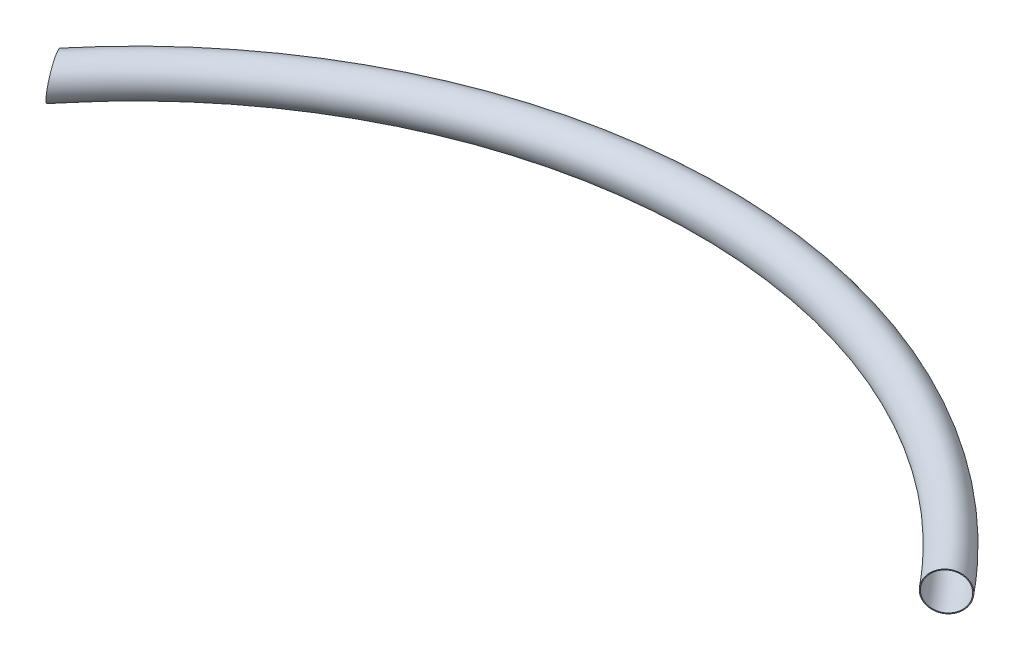
ISO-10303-21;
HEADER;
FILE_DESCRIPTION(('STEP AP214'),'2;1');
FILE_NAME('part.step','',(''),(''),'','','');
FILE_SCHEMA(('AUTOMOTIVE_DESIGN { 1 0 10303 214 1 1 1 1 }'));
ENDSEC;
DATA;
#1=APPLICATION_CONTEXT('core data for automotive mechanical design processes');
#2=APPLICATION_PROTOCOL_DEFINITION('international standard','automotive_design',2000,#1);
#3=PRODUCT_CONTEXT('',#1,'mechanical');
#4=PRODUCT('Part','Part','',(#3));
#5=PRODUCT_RELATED_PRODUCT_CATEGORY('part','',(#4));
#6=PRODUCT_DEFINITION_FORMATION('','',#4);
#7=PRODUCT_DEFINITION_CONTEXT('part definition',#1,'design');
#8=PRODUCT_DEFINITION('design','',#6,#7);
#9=PRODUCT_DEFINITION_SHAPE('','',#8);
#10=(LENGTH_UNIT() NAMED_UNIT(*) SI_UNIT(.MILLI.,.METRE.));
#11=(NAMED_UNIT(*) PLANE_ANGLE_UNIT() SI_UNIT($,.RADIAN.));
#12=(NAMED_UNIT(*) SI_UNIT($,.STERADIAN.) SOLID_ANGLE_UNIT());
#13=UNCERTAINTY_MEASURE_WITH_UNIT(LENGTH_MEASURE(1.E-05),#10,'distance_accuracy_value','');
#14=(GEOMETRIC_REPRESENTATION_CONTEXT(3) GLOBAL_UNCERTAINTY_ASSIGNED_CONTEXT((#13)) GLOBAL_UNIT_ASSIGNED_CONTEXT((#10,
#11,#12)) REPRESENTATION_CONTEXT('',''));
#15=CARTESIAN_POINT('',(0.,0.,0.));
#16=DIRECTION('',(0.,0.,1.));
#17=DIRECTION('',(1.,0.,0.));
#18=AXIS2_PLACEMENT_3D('',#15,#16,#17);
#19=CARTESIAN_POINT('',(0.,0.,1141.91160740362));
#20=DIRECTION('',(0.,-1.,0.));
#21=DIRECTION('',(0.,0.,-1.));
#22=AXIS2_PLACEMENT_3D('',#19,#20,#21);
#23=TOROIDAL_SURFACE('',#22,2500.81160740362,80.7338999999999);
#24=CARTESIAN_POINT('',(-1979.20686929793,-35.3852383598707,-502.780856281421));
#25=CARTESIAN_POINT('',(-1979.3991245248,-34.4097320346067,-503.293783131036));
#26=CARTESIAN_POINT('',(-1979.58008716303,-33.4234639280079,-503.790337505917));
#27=CARTESIAN_POINT('',(-1979.91897412592,-31.4308692296872,-504.749660949201));
#28=CARTESIAN_POINT('',(-1980.07690156036,-30.4245453663966,-505.212434573812));
#29=CARTESIAN_POINT('',(-1980.36933264064,-28.3931034040865,-506.103307878676));
#30=CARTESIAN_POINT('',(-1980.50383206896,-27.3679819577447,-506.531401308362));
#31=CARTESIAN_POINT('',(-1980.74898213253,-25.3006826151863,-507.351864955006));
#32=CARTESIAN_POINT('',(-1980.85963191885,-24.2585041132471,-507.744233900069));
#33=CARTESIAN_POINT('',(-1981.05676831842,-22.1582614653444,-508.492495595245));
#34=CARTESIAN_POINT('',(-1981.14324238078,-21.1001893674171,-508.848369338327));
#35=CARTESIAN_POINT('',(-1981.29164037947,-18.9703377150809,-509.522564850369));
#36=CARTESIAN_POINT('',(-1981.35356212045,-17.8985569437548,-509.840883259542));
#37=CARTESIAN_POINT('',(-1981.4525659267,-15.7433195508101,-510.439081929846));
#38=CARTESIAN_POINT('',(-1981.48965094582,-14.6598643332236,-510.718966758772));
#39=CARTESIAN_POINT('',(-1981.53877120841,-12.4829229907933,-511.239620734417));
#40=CARTESIAN_POINT('',(-1981.55080413865,-11.3894359490102,-511.480386267112));
#41=CARTESIAN_POINT('',(-1981.54963958368,-9.19268637284343,-511.922453337221));
#42=CARTESIAN_POINT('',(-1981.53640135289,-8.0894109112362,-512.123690564743));
#43=CARTESIAN_POINT('',(-1981.48449256695,-5.87671522718252,-512.485635600726));
#44=CARTESIAN_POINT('',(-1981.4458195946,-4.76729443064839,-512.646339555076));
#45=CARTESIAN_POINT('',(-1981.34298157329,-2.54453611819841,-512.92666960051));
#46=CARTESIAN_POINT('',(-1981.27881851067,-1.43119891417158,-513.046298891027));
#47=CARTESIAN_POINT('',(-1981.12499158504,0.797507777516503,-513.244084421601));
#48=CARTESIAN_POINT('',(-1981.03532525997,1.91287745105521,-513.322236655431));
#49=CARTESIAN_POINT('',(-1980.83058715901,4.14307701744504,-513.436704845798));
#50=CARTESIAN_POINT('',(-1980.715523482,5.25790696908317,-513.47303411621));
#51=CARTESIAN_POINT('',(-1980.46008741844,7.48535285808895,-513.503676897148));
#52=CARTESIAN_POINT('',(-1980.31971249135,8.59796856186196,-513.497986187721));
#53=CARTESIAN_POINT('',(-1980.01386331799,10.8186100605355,-513.444452735829));
#54=CARTESIAN_POINT('',(-1979.84839218149,11.9266364066669,-513.396615212387));
#55=CARTESIAN_POINT('',(-1979.49259951448,14.136086708019,-513.258790241673));
#56=CARTESIAN_POINT('',(-1979.30227564159,15.2375100306537,-513.168798819299));
#57=CARTESIAN_POINT('',(-1978.70717079521,18.4598326055181,-512.842624740278));
#58=CARTESIAN_POINT('',(-1978.26853304244,20.5690309131438,-512.548469165553));
#59=CARTESIAN_POINT('',(-1977.30217837921,24.7385461549988,-511.803970653447));
#60=CARTESIAN_POINT('',(-1976.77446332982,26.7988641094487,-511.353630978977));
#61=CARTESIAN_POINT('',(-1975.63384164525,30.8557352386496,-510.300141360386));
#62=CARTESIAN_POINT('',(-1975.02094243889,32.8522939551199,-509.697004737744));
#63=CARTESIAN_POINT('',(-1973.71464122692,36.767308869152,-508.342724554317));
#64=CARTESIAN_POINT('',(-1973.02123946605,38.6857653041252,-507.591581443474));
#65=CARTESIAN_POINT('',(-1971.57000943179,42.403812241093,-505.959454185326));
#66=CARTESIAN_POINT('',(-1970.81326552163,44.2047262215226,-505.080518535497));
#67=CARTESIAN_POINT('',(-1969.23265760134,47.7057112443546,-503.192024700908));
#68=CARTESIAN_POINT('',(-1968.40879458239,49.4057837752954,-502.182468444964));
#69=CARTESIAN_POINT('',(-1966.70014661937,52.6944525477766,-500.040764509439));
#70=CARTESIAN_POINT('',(-1965.81536007325,54.2830458556494,-498.908613605673));
#71=CARTESIAN_POINT('',(-1963.99143946698,57.3392969371135,-496.530606730909));
#72=CARTESIAN_POINT('',(-1963.05230429106,58.8069522263534,-495.284748425202));
#73=CARTESIAN_POINT('',(-1961.10499502209,61.6444780953998,-492.659875808819));
#74=CARTESIAN_POINT('',(-1960.09574843969,63.0114385623151,-491.278511832025));
#75=CARTESIAN_POINT('',(-1958.03493708867,65.6031536085332,-488.417537480918));
#76=CARTESIAN_POINT('',(-1956.98337192124,66.8279068472306,-486.937926180623));
#77=CARTESIAN_POINT('',(-1954.84517020738,69.1294613242307,-483.891198368159));
#78=CARTESIAN_POINT('',(-1953.7585288182,70.2062420240797,-482.324069751034));
#79=CARTESIAN_POINT('',(-1951.55763331375,72.2070590909237,-479.113589202808));
#80=CARTESIAN_POINT('',(-1950.44337839745,73.1310910208971,-477.470235059294));
#81=CARTESIAN_POINT('',(-1948.13815927148,74.8653294362463,-474.034530603023));
#82=CARTESIAN_POINT('',(-1946.94614646326,75.6675272768953,-472.238839411558));
#83=CARTESIAN_POINT('',(-1944.54773113599,77.0970553839469,-468.588480581178));
#84=CARTESIAN_POINT('',(-1943.34132820753,77.7243806624433,-466.733811261704));
#85=CARTESIAN_POINT('',(-1940.92175009196,78.802782977862,-462.977728416542));
#86=CARTESIAN_POINT('',(-1939.70857358884,79.2538244642697,-461.076305544327));
#87=CARTESIAN_POINT('',(-1937.28325281461,79.9790415127317,-457.239409241176));
#88=CARTESIAN_POINT('',(-1936.07110857424,80.253211979053,-455.303934830851));
#89=CARTESIAN_POINT('',(-1933.5832744689,80.6361808602753,-451.295192547975));
#90=CARTESIAN_POINT('',(-1932.30809119031,80.7341781945253,-449.220573737698));
#91=CARTESIAN_POINT('',(-1929.77538238225,80.7336205870288,-445.060613378186));
#92=CARTESIAN_POINT('',(-1928.51785750743,80.6350583775755,-442.975271435312));
#93=CARTESIAN_POINT('',(-1926.02822139539,80.2436950901279,-438.807071027152));
#94=CARTESIAN_POINT('',(-1924.7961155865,79.9508529568476,-436.724213180026));
#95=CARTESIAN_POINT('',(-1922.36530580337,79.1740204650871,-432.57472582036));
#96=CARTESIAN_POINT('',(-1921.16660249877,78.6900262774274,-430.508096633761));
#97=CARTESIAN_POINT('',(-1918.75570341682,77.5080443416732,-426.309427822483));
#98=CARTESIAN_POINT('',(-1917.54543333223,76.801219731487,-424.17876505492));
#99=CARTESIAN_POINT('',(-1915.17790837901,75.1876982227603,-419.964118653642));
#100=CARTESIAN_POINT('',(-1914.02065529094,74.2809946172786,-417.880136588884));
#101=CARTESIAN_POINT('',(-1911.767103255,72.2735066983154,-413.773061401993));
#102=CARTESIAN_POINT('',(-1910.67081324538,71.1726940231878,-411.749977228405));
#103=CARTESIAN_POINT('',(-1908.54734944141,68.7839606221136,-407.779512851352));
#104=CARTESIAN_POINT('',(-1907.52017550308,67.4960402859469,-405.832132490193));
#105=CARTESIAN_POINT('',(-1905.53111871811,64.7245475347052,-402.005066350618));
#106=CARTESIAN_POINT('',(-1904.57012747232,63.2388862905342,-400.126422813802));
#107=CARTESIAN_POINT('',(-1903.19377060545,60.8798779421934,-397.389051908668));
#108=CARTESIAN_POINT('',(-1902.74577686396,60.0716563517342,-396.489896844471));
#109=CARTESIAN_POINT('',(-1901.87240942962,58.4128565547509,-394.720178421511));
#110=CARTESIAN_POINT('',(-1901.44703342148,57.5622827009975,-393.849612139725));
#111=CARTESIAN_POINT('',(-1900.61983190796,55.8200388420599,-392.138854255443));
#112=CARTESIAN_POINT('',(-1900.21800783735,54.9283663390361,-391.298664504683));
#113=CARTESIAN_POINT('',(-1899.43891397681,53.1054675284855,-389.650620057563));
#114=CARTESIAN_POINT('',(-1899.0616416026,52.1742454009919,-388.842761961485));
#115=CARTESIAN_POINT('',(-1898.33250971175,50.2735987282997,-387.261064118955));
#116=CARTESIAN_POINT('',(-1897.98065220301,49.3041711740294,-386.487227062207));
#117=CARTESIAN_POINT('',(-1897.30333029898,47.328898438217,-384.975542039371));
#118=CARTESIAN_POINT('',(-1896.97786293388,46.3230573729528,-384.237690027435));
#119=CARTESIAN_POINT('',(-1896.36427755386,44.3097517455021,-382.82300232389));
#120=CARTESIAN_POINT('',(-1896.07529082022,43.3033967550287,-382.144964058068));
#121=CARTESIAN_POINT('',(-1895.52362731844,41.2598693025282,-380.825871884782));
#122=CARTESIAN_POINT('',(-1895.26094760298,40.2227003096928,-380.184813837629));
#123=CARTESIAN_POINT('',(-1894.76258654337,38.119080354742,-378.941123110482));
#124=CARTESIAN_POINT('',(-1894.52690813079,37.0526262286418,-378.338494605994));
#125=CARTESIAN_POINT('',(-1894.0833247529,34.892521313549,-377.17335744398));
#126=CARTESIAN_POINT('',(-1893.87541678151,33.7988734834168,-376.610844447153));
#127=CARTESIAN_POINT('',(-1893.48806051126,31.5864488498346,-375.527483286934));
#128=CARTESIAN_POINT('',(-1893.30860686449,30.4676768136249,-375.006627303391));
#129=CARTESIAN_POINT('',(-1892.97876517007,28.2070086670862,-374.007980579284));
#130=CARTESIAN_POINT('',(-1892.82837395298,27.0651150933308,-373.530185145729));
#131=CARTESIAN_POINT('',(-1892.55721619487,24.7602715033133,-372.61899566165));
#132=CARTESIAN_POINT('',(-1892.43644989559,23.5973213153167,-372.185601973452));
#133=CARTESIAN_POINT('',(-1892.22507230736,21.2526888629363,-371.364556799671));
#134=CARTESIAN_POINT('',(-1892.13446055547,20.0710068864204,-370.97690461191));
#135=CARTESIAN_POINT('',(-1891.988678112,17.7675641181711,-370.271920934094));
#136=CARTESIAN_POINT('',(-1891.93160887285,16.6468141593748,-369.951675471568));
#137=CARTESIAN_POINT('',(-1891.84460821734,14.3929847492143,-369.353265180203));
#138=CARTESIAN_POINT('',(-1891.8146789817,13.2599043144855,-369.075103734352));
#139=CARTESIAN_POINT('',(-1891.78223269777,10.9837348268433,-368.561781172809));
#140=CARTESIAN_POINT('',(-1891.77971373032,9.84064648025666,-368.326617047733));
#141=CARTESIAN_POINT('',(-1891.80228340571,7.54660657875494,-367.900043703806));
#142=CARTESIAN_POINT('',(-1891.82737187913,6.39565507214174,-367.708634216427));
#143=CARTESIAN_POINT('',(-1891.90527696413,4.08850408874172,-367.370296668432));
#144=CARTESIAN_POINT('',(-1891.9580854991,2.93230623777456,-367.223355670958));
#145=CARTESIAN_POINT('',(-1892.0914787363,0.616787702436868,-366.974463494448));
#146=CARTESIAN_POINT('',(-1892.17206064849,-0.542532656651866,-366.872507798647));
#147=CARTESIAN_POINT('',(-1892.3609862143,-2.8620359722358,-366.71401934264));
#148=CARTESIAN_POINT('',(-1892.4693302846,-4.0222189414175,-366.65748726426));
#149=CARTESIAN_POINT('',(-1892.71368341229,-6.3409910323074,-366.590183595107));
#150=CARTESIAN_POINT('',(-1892.84969208349,-7.49958017603704,-366.579411365604));
#151=CARTESIAN_POINT('',(-1893.13980422272,-9.74017626812418,-366.603064550224));
#152=CARTESIAN_POINT('',(-1893.29223838423,-10.8224300270852,-366.634698329509));
#153=CARTESIAN_POINT('',(-1893.62105748527,-12.9814485109549,-366.738413219747));
#154=CARTESIAN_POINT('',(-1893.79744446845,-14.0582127593601,-366.810497783581));
#155=CARTESIAN_POINT('',(-1894.1738571996,-16.2039673751841,-366.995063561691));
#156=CARTESIAN_POINT('',(-1894.3738797116,-17.2729587855653,-367.107539250267));
#157=CARTESIAN_POINT('',(-1894.79726430162,-19.4013926729709,-367.372754610397));
#158=CARTESIAN_POINT('',(-1895.0206286545,-20.4608342083251,-367.52549820863));
#159=CARTESIAN_POINT('',(-1895.49021311669,-22.567756329588,-367.870942241804));
#160=CARTESIAN_POINT('',(-1895.73642684442,-23.6152401639134,-368.063631538803));
#161=CARTESIAN_POINT('',(-1896.25132559811,-25.6966689032515,-368.488654437833));
#162=CARTESIAN_POINT('',(-1896.5200128768,-26.7306124389441,-368.720992016634));
#163=CARTESIAN_POINT('',(-1897.07928555813,-28.7827984087923,-369.224807060611));
#164=CARTESIAN_POINT('',(-1897.36986864314,-29.8010424909917,-369.496280386133));
#165=CARTESIAN_POINT('',(-1897.97240897862,-31.8201400587457,-370.077847807733));
#166=CARTESIAN_POINT('',(-1898.28436823432,-32.8209919017266,-370.387945529264));
#167=CARTESIAN_POINT('',(-1898.91970585018,-34.7747646983949,-371.036583478036));
#168=CARTESIAN_POINT('',(-1899.24249526736,-35.7282354763952,-371.374045272173));
#169=CARTESIAN_POINT('',(-1899.90702097686,-37.6153955537377,-372.084086143379));
#170=CARTESIAN_POINT('',(-1900.24875898371,-38.5490830524206,-372.456668400413));
#171=CARTESIAN_POINT('',(-1900.95045952312,-40.3949220879162,-373.236118368949));
#172=CARTESIAN_POINT('',(-1901.31041984548,-41.3070762169386,-373.642981926411));
#173=CARTESIAN_POINT('',(-1902.0479041242,-43.1084821659626,-374.490185163368));
#174=CARTESIAN_POINT('',(-1902.42542970494,-43.9977318559701,-374.930527941317));
#175=CARTESIAN_POINT('',(-1903.58321019777,-46.6287743507846,-376.300370854118));
#176=CARTESIAN_POINT('',(-1904.38885074788,-48.3343386360894,-377.278887690211));
#177=CARTESIAN_POINT('',(-1906.06122218913,-51.637203944515,-379.358140023529));
#178=CARTESIAN_POINT('',(-1906.9279543328,-53.2345027466372,-380.458878026822));
#179=CARTESIAN_POINT('',(-1908.73101837575,-56.3374965250335,-382.793181984023));
#180=CARTESIAN_POINT('',(-1909.66826786064,-57.8412269450004,-384.028652078185));
#181=CARTESIAN_POINT('',(-1911.59227189124,-60.719153126693,-386.607081794681));
#182=CARTESIAN_POINT('',(-1912.57902667865,-62.0933482559314,-387.950041941801));
#183=CARTESIAN_POINT('',(-1914.59509278732,-64.7054754903019,-390.733399009757));
#184=CARTESIAN_POINT('',(-1915.62441004461,-65.9433884999331,-392.173809539553));
#185=CARTESIAN_POINT('',(-1917.71838962146,-68.277100415422,-395.141405438825));
#186=CARTESIAN_POINT('',(-1918.78305303397,-69.3728949216279,-396.668593492624));
#187=CARTESIAN_POINT('',(-1920.99605488155,-71.4703446480976,-399.879427909191));
#188=CARTESIAN_POINT('',(-1922.14588495556,-72.4642946171001,-401.567081504281));
#189=CARTESIAN_POINT('',(-1924.4688987967,-74.2863091605274,-405.014272668116));
#190=CARTESIAN_POINT('',(-1925.6420832338,-75.1143689685286,-406.773812300572));
#191=CARTESIAN_POINT('',(-1928.0043086435,-76.6020583027343,-410.352976173424));
#192=CARTESIAN_POINT('',(-1929.19335291969,-77.2616521423579,-412.172613052336));
#193=CARTESIAN_POINT('',(-1931.57957099481,-78.4105334577448,-415.859659356187));
#194=CARTESIAN_POINT('',(-1932.77674503969,-78.8998157574236,-417.727070231217));
#195=CARTESIAN_POINT('',(-1935.24773954448,-79.7328325930581,-421.617196197888));
#196=CARTESIAN_POINT('',(-1936.52162121262,-80.0654112984726,-423.642266499163));
#197=CARTESIAN_POINT('',(-1939.06201166785,-80.5372204949395,-427.719374657352));
#198=CARTESIAN_POINT('',(-1940.32852016515,-80.6764434366871,-429.771413564059));
#199=CARTESIAN_POINT('',(-1942.84627640487,-80.7624864415937,-433.889312434943));
#200=CARTESIAN_POINT('',(-1944.09752137258,-80.7092720301053,-435.955174809383));
#201=CARTESIAN_POINT('',(-1946.57670524519,-80.4120886405691,-440.087173463052));
#202=CARTESIAN_POINT('',(-1947.80464367754,-80.1681157990095,-442.15330974698));
#203=CARTESIAN_POINT('',(-1950.28953898218,-79.4751596662172,-446.374677823235));
#204=CARTESIAN_POINT('',(-1951.54493050964,-79.0166398439304,-448.529266020335));
#205=CARTESIAN_POINT('',(-1954.01329740804,-77.8957187639052,-452.809981985326));
#206=CARTESIAN_POINT('',(-1955.22627114525,-77.2333096629452,-454.936108655075));
#207=CARTESIAN_POINT('',(-1957.00747426798,-76.09030178805,-458.092656363928));
#208=CARTESIAN_POINT('',(-1957.59501605979,-75.6842447472828,-459.139731614284));
#209=CARTESIAN_POINT('',(-1958.75631326806,-74.8229397773316,-461.221180534931));
#210=CARTESIAN_POINT('',(-1959.33006993526,-74.3676963317048,-462.255555353368));
#211=CARTESIAN_POINT('',(-1960.46282824634,-73.4086699017895,-464.309880811555));
#212=CARTESIAN_POINT('',(-1961.02182871085,-72.9048830526634,-465.32983029539));
#213=CARTESIAN_POINT('',(-1962.12398089256,-71.849596848008,-467.353341547854));
#214=CARTESIAN_POINT('',(-1962.66713405918,-71.2981018743759,-468.356904811481));
#215=CARTESIAN_POINT('',(-1963.74525501288,-70.1389147113156,-470.361945146491));
#216=CARTESIAN_POINT('',(-1964.279950203,-69.5304606673519,-471.363128467572));
#217=CARTESIAN_POINT('',(-1965.33090976126,-68.2660724248427,-473.344819505892));
#218=CARTESIAN_POINT('',(-1965.84717587541,-67.6101427421362,-474.325329178162));
#219=CARTESIAN_POINT('',(-1966.86039506002,-66.251620525409,-476.264058730539));
#220=CARTESIAN_POINT('',(-1967.35734461989,-65.5490195716453,-477.222274546385));
#221=CARTESIAN_POINT('',(-1968.33076523101,-64.098402375491,-479.114250026108));
#222=CARTESIAN_POINT('',(-1968.80723834263,-63.3503907207315,-480.048012146831));
#223=CARTESIAN_POINT('',(-1969.73829261827,-61.8107982163296,-481.888385623848));
#224=CARTESIAN_POINT('',(-1970.19289501851,-61.0192612982224,-482.795022980671));
#225=CARTESIAN_POINT('',(-1971.07967786072,-59.3932557825331,-484.580147567102));
#226=CARTESIAN_POINT('',(-1971.51186053731,-58.5587914802009,-485.458637598871));
#227=CARTESIAN_POINT('',(-1972.35280656927,-56.8483186526514,-487.185549000865));
#228=CARTESIAN_POINT('',(-1972.76157425666,-55.9723178672943,-488.033975921932));
#229=CARTESIAN_POINT('',(-1973.55478177764,-54.180143668117,-489.698991673488));
#230=CARTESIAN_POINT('',(-1973.93922291365,-53.2639724094633,-490.515582207586));
#231=CARTESIAN_POINT('',(-1974.81937574526,-51.0494156313781,-492.40876801837));
#232=CARTESIAN_POINT('',(-1975.3041594069,-49.734129070843,-493.470830374279));
#233=CARTESIAN_POINT('',(-1975.99410279998,-47.7104219173545,-495.013034526311));
#234=CARTESIAN_POINT('',(-1976.21786273529,-47.027444694523,-495.518583929317));
#235=CARTESIAN_POINT('',(-1976.65278508178,-45.6448897641294,-496.512347015614));
#236=CARTESIAN_POINT('',(-1976.86394560391,-44.9453095891301,-497.000558094924));
#237=CARTESIAN_POINT('',(-1977.47801500378,-42.8228191054174,-498.438107866587));
#238=CARTESIAN_POINT('',(-1977.86159980472,-41.3759006505434,-499.36055995727));
#239=CARTESIAN_POINT('',(-1978.57503479884,-38.4232531185606,-501.129093804354));
#240=CARTESIAN_POINT('',(-1978.90488302623,-36.9175218924638,-501.975172766374));
#241=CARTESIAN_POINT('',(-1979.20686929793,-35.3852383598707,-502.780856281421));
#242=B_SPLINE_CURVE_WITH_KNOTS('',3,(#24,#25,#26,#27,#28,#29,#30,#31,#32,#33,#34,#35,#36,#37,
#38,#39,#40,#41,#42,#43,#44,#45,#46,#47,#48,#49,#50,#51,#52,#53,#54,#55,#56,#57,#58,#59,#60,#61,
#62,#63,#64,#65,#66,#67,#68,#69,#70,#71,#72,#73,#74,#75,#76,#77,#78,#79,#80,#81,#82,#83,#84,#85,
#86,#87,#88,#89,#90,#91,#92,#93,#94,#95,#96,#97,#98,#99,#100,#101,#102,#103,#104,#105,#106,#107,
#108,#109,#110,#111,#112,#113,#114,#115,#116,#117,#118,#119,#120,#121,#122,#123,#124,#125,#126,
#127,#128,#129,#130,#131,#132,#133,#134,#135,#136,#137,#138,#139,#140,#141,#142,#143,#144,#145,
#146,#147,#148,#149,#150,#151,#152,#153,#154,#155,#156,#157,#158,#159,#160,#161,#162,#163,#164,
#165,#166,#167,#168,#169,#170,#171,#172,#173,#174,#175,#176,#177,#178,#179,#180,#181,#182,#183,
#184,#185,#186,#187,#188,#189,#190,#191,#192,#193,#194,#195,#196,#197,#198,#199,#200,#201,#202,
#203,#204,#205,#206,#207,#208,#209,#210,#211,#212,#213,#214,#215,#216,#217,#218,#219,#220,#221,
#222,#223,#224,#225,#226,#227,#228,#229,#230,#231,#232,#233,#234,#235,#236,#237,#238,#239,#240,
#241),.UNSPECIFIED.,.T.,.F.,(4,2,2,2,2,2,2,2,2,2,2,2,2,2,2,2,2,2,2,2,2,2,2,2,2,2,2,2,2,2,2,2,2,
2,2,2,2,2,2,2,2,2,2,2,2,2,2,2,2,2,2,2,2,2,2,2,2,2,2,2,2,2,2,2,2,2,2,2,2,2,2,2,2,2,2,2,2,2,2,2,2,
2,2,2,2,2,2,2,2,2,2,2,2,2,2,2,2,2,2,2,2,2,2,2,2,2,2,2,4),(0.,3.35599820151092,6.71154292036247,
10.067691084713,13.4239586908441,16.7819654877918,20.1402724724122,23.4981799793419,
26.8563975293131,30.2200342251256,33.5839906321784,36.9476849506981,40.311704105863,
43.6746520665102,47.0379377636162,50.4008070449817,53.7639935078935,60.2782743286443,
66.7924190648426,73.3059960658754,79.8195532657752,86.2383256914215,92.6570033448486,
99.0758498477722,105.49482817604,112.05693649182,118.619106664397,125.182186742247,
131.745457429901,138.637123706034,145.528986533692,152.422238502123,159.315689059349,
166.618980003533,173.922540988844,181.227645856458,188.532897068181,196.17493538131,
203.817230162138,211.460642499879,219.104038915207,226.835756153953,230.702790108578,
234.569427444313,238.436300092122,242.302765059042,246.169535160968,250.035869509741,
253.776872208512,257.517455311077,261.25844415117,264.999027712115,268.738907407805,
272.47837901533,276.217881135164,279.957325842385,283.457216199552,286.957387751479,
290.457314232412,293.957219233283,297.456105054131,300.954639488122,304.453226435513,
307.951764548407,311.230937033448,314.510389471367,317.789393435279,321.068717265796,
324.347127958937,327.62586767402,330.904260828636,334.182961939727,337.367089117346,
340.551504877565,343.735535319199,346.919860797849,353.286866925318,359.654003628417,
366.127001207478,372.600030390875,379.073965407237,385.548100793452,392.354112130252,
399.160318992107,405.967966436772,412.775820760445,420.01402670011,427.252515237435,
434.492300595243,441.732232587308,449.329993171486,456.92804606318,460.729530070552,
464.530667847819,468.332108507385,472.133200382074,475.995493037249,479.857418796278,
483.720043169213,487.582277966534,491.44068358704,495.298703889335,499.156008096296,
503.013105609523,508.285404356072,510.921146589805,513.557283016426,518.828548387786,
524.100006548957),.UNSPECIFIED.);
#243=CARTESIAN_POINT('',(-1979.20686929793,-35.3852383598707,-502.780856281421));
#244=VERTEX_POINT('',#243);
#245=EDGE_CURVE('E48',#244,#244,#242,.T.);
#246=ORIENTED_EDGE('',*,*,#245,.F.);
#247=EDGE_LOOP('',(#246));
#248=FACE_BOUND('',#247,.T.);
#249=CARTESIAN_POINT('',(1936.74818533626,0.,-440.196215192992));
#250=DIRECTION('',(-0.632637747646725,0.,-0.77444785508934));
#251=DIRECTION('',(-0.77444785508934,0.,0.632637747646725));
#252=AXIS2_PLACEMENT_3D('',#249,#250,#251);
#253=CIRCLE('',#252,80.7338999999999);
#254=CARTESIAN_POINT('',(1874.22398964826,0.,-389.120902538256));
#255=VERTEX_POINT('',#254);
#256=EDGE_CURVE('E52',#255,#255,#253,.T.);
#257=ORIENTED_EDGE('',*,*,#256,.F.);
#258=EDGE_LOOP('',(#257));
#259=FACE_BOUND('',#258,.T.);
#260=ADVANCED_FACE('F37',(#248,#259),#23,.F.);
#261=CARTESIAN_POINT('',(559.47382164096,0.,684.883731266744));
#262=DIRECTION('',(-0.632637747646725,0.,-0.77444785508934));
#263=DIRECTION('',(-0.77444785508934,0.,0.632637747646725));
#264=AXIS2_PLACEMENT_3D('',#261,#262,#263);
#265=PLANE('',#264);
#266=ORIENTED_EDGE('',*,*,#256,.T.);
#267=EDGE_LOOP('',(#266));
#268=FACE_BOUND('',#267,.T.);
#269=CARTESIAN_POINT('',(1936.74818533626,0.,-440.196215192992));
#270=DIRECTION('',(-0.632637747646725,0.,-0.77444785508934));
#271=DIRECTION('',(-0.77444785508934,0.,0.632637747646725));
#272=AXIS2_PLACEMENT_3D('',#269,#270,#271);
#273=CIRCLE('',#272,84.1374999999999);
#274=CARTESIAN_POINT('',(1871.58807892868,0.,-386.967656700366));
#275=VERTEX_POINT('',#274);
#276=EDGE_CURVE('E57',#275,#275,#273,.T.);
#277=ORIENTED_EDGE('',*,*,#276,.F.);
#278=EDGE_LOOP('',(#277));
#279=FACE_BOUND('',#278,.T.);
#280=ADVANCED_FACE('F66',(#268,#279),#265,.F.);
#281=CARTESIAN_POINT('',(0.,0.,1141.91160740362));
#282=DIRECTION('',(0.,-1.,0.));
#283=DIRECTION('',(0.,0.,-1.));
#284=AXIS2_PLACEMENT_3D('',#281,#282,#283);
#285=TOROIDAL_SURFACE('',#284,2500.81160740362,84.1374999999999);
#286=CARTESIAN_POINT('',(-1980.7480870676,-38.0946259409138,-504.764641624163));
#287=CARTESIAN_POINT('',(-1980.9583149747,-37.0845888247405,-505.314066638411));
#288=CARTESIAN_POINT('',(-1981.15681522281,-36.0629811665176,-505.846568053307));
#289=CARTESIAN_POINT('',(-1981.52987251687,-33.9981352438937,-506.876617079955));
#290=CARTESIAN_POINT('',(-1981.70443278929,-32.9548999161744,-507.374169397477));
#291=CARTESIAN_POINT('',(-1982.02919459607,-30.8481015528841,-508.333374406735));
#292=CARTESIAN_POINT('',(-1982.17939173785,-29.7845348902167,-508.795020616963));
#293=CARTESIAN_POINT('',(-1982.45496546536,-27.6388690179539,-509.68129208297));
#294=CARTESIAN_POINT('',(-1982.58034116888,-26.5567691511439,-510.105916022618));
#295=CARTESIAN_POINT('',(-1982.80593116805,-24.375240933762,-510.917339765066));
#296=CARTESIAN_POINT('',(-1982.9061323103,-23.2758038421976,-511.304119730691));
#297=CARTESIAN_POINT('',(-1983.08094573058,-21.0618593834995,-512.038697048377));
#298=CARTESIAN_POINT('',(-1983.15555572151,-19.9473506786526,-512.386490914357));
#299=CARTESIAN_POINT('',(-1983.27886275334,-17.7053683018974,-513.042138239132));
#300=CARTESIAN_POINT('',(-1983.32756287501,-16.5778961876758,-513.349996443119));
#301=CARTESIAN_POINT('',(-1983.39881230069,-14.3116925421489,-513.925037053603));
#302=CARTESIAN_POINT('',(-1983.4213591902,-13.1729599810517,-514.192215702538));
#303=CARTESIAN_POINT('',(-1983.44010764792,-10.8844520206059,-514.685533968172));
#304=CARTESIAN_POINT('',(-1983.43626565382,-9.7346614921857,-514.911605093647));
#305=CARTESIAN_POINT('',(-1983.40198569375,-7.42785558063677,-515.321524987839));
#306=CARTESIAN_POINT('',(-1983.37154519925,-6.270839521009,-515.505369740288));
#307=CARTESIAN_POINT('',(-1983.28398125152,-3.95190245457171,-515.830225145894));
#308=CARTESIAN_POINT('',(-1983.22685986859,-2.78998183525975,-515.971239121082));
#309=CARTESIAN_POINT('',(-1983.08590328033,-0.463200281571661,-516.209985213063));
#310=CARTESIAN_POINT('',(-1983.0020654943,0.701660926065756,-516.307713146406));
#311=CARTESIAN_POINT('',(-1982.80774392345,3.03168986444717,-516.459466242153));
#312=CARTESIAN_POINT('',(-1982.69726739502,4.19685742554811,-516.513503288549));
#313=CARTESIAN_POINT('',(-1982.44976222194,6.52558512507895,-516.57764198485));
#314=CARTESIAN_POINT('',(-1982.31273354239,7.68914526139473,-516.587743577025));
#315=CARTESIAN_POINT('',(-1982.01230226694,10.0123699430484,-516.563841593038));
#316=CARTESIAN_POINT('',(-1981.8489004071,11.1720345961857,-516.529839247613));
#317=CARTESIAN_POINT('',(-1981.49596183552,13.4852394008656,-516.417671560103));
#318=CARTESIAN_POINT('',(-1981.30642512211,14.6387795520158,-516.339506215188));
#319=CARTESIAN_POINT('',(-1980.90803171202,16.9005471557699,-516.14228537726));
#320=CARTESIAN_POINT('',(-1980.6999909454,18.0090401083174,-516.024623668169));
#321=CARTESIAN_POINT('',(-1980.26004472095,20.2162082910846,-515.748119450835));
#322=CARTESIAN_POINT('',(-1980.02813721186,21.314882668591,-515.589273401128));
#323=CARTESIAN_POINT('',(-1979.54089459399,23.500184421973,-515.230667849249));
#324=CARTESIAN_POINT('',(-1979.28556210474,24.5868131296691,-515.030912918669));
#325=CARTESIAN_POINT('',(-1978.75191408556,26.7461553118934,-514.590842187204));
#326=CARTESIAN_POINT('',(-1978.47359634945,27.8188674392014,-514.350522490461));
#327=CARTESIAN_POINT('',(-1977.60501658499,31.0127316560661,-513.569427872959));
#328=CARTESIAN_POINT('',(-1976.98094613488,33.110427006248,-512.968383523395));
#329=CARTESIAN_POINT('',(-1975.64775659383,37.2265312359899,-511.61058228279));
#330=CARTESIAN_POINT('',(-1974.9386378697,39.2449404574626,-510.853826063327));
#331=CARTESIAN_POINT('',(-1973.45297825977,43.1565095327621,-509.204262243218));
#332=CARTESIAN_POINT('',(-1972.67771757725,45.0511699475705,-508.313860587268));
#333=CARTESIAN_POINT('',(-1971.05612382025,48.7375475952439,-506.395518823074));
#334=CARTESIAN_POINT('',(-1970.20979187354,50.5292664608518,-505.367580897135));
#335=CARTESIAN_POINT('',(-1968.4524339453,53.9984609146226,-503.182358890594));
#336=CARTESIAN_POINT('',(-1967.54140667491,55.6759342254952,-502.025072232858));
#337=CARTESIAN_POINT('',(-1965.66144871266,58.9065363341075,-499.590264469329));
#338=CARTESIAN_POINT('',(-1964.69251687363,60.4596626669228,-498.312740981178));
#339=CARTESIAN_POINT('',(-1962.68328060856,63.4634870254523,-495.619766557317));
#340=CARTESIAN_POINT('',(-1961.64191657362,64.9114132457368,-494.202015063998));
#341=CARTESIAN_POINT('',(-1959.5138484834,67.6607942921551,-491.262440376973));
#342=CARTESIAN_POINT('',(-1958.42714405222,68.9622479035981,-489.740616320367));
#343=CARTESIAN_POINT('',(-1956.215918443,71.4124664212242,-486.60399654168));
#344=CARTESIAN_POINT('',(-1955.09139221021,72.5612108159753,-484.98918837192));
#345=CARTESIAN_POINT('',(-1952.81227136279,74.700800936492,-481.678273696017));
#346=CARTESIAN_POINT('',(-1951.65767588268,75.691642111449,-479.982164848599));
#347=CARTESIAN_POINT('',(-1949.26877857408,77.556237094848,-476.435369212236));
#348=CARTESIAN_POINT('',(-1948.03334256435,78.421879444374,-474.581180199743));
#349=CARTESIAN_POINT('',(-1945.54607416362,79.972261092355,-470.809310055601));
#350=CARTESIAN_POINT('',(-1944.29424131821,80.6569953660458,-468.89162716206));
#351=CARTESIAN_POINT('',(-1941.78210940211,81.8439321727233,-465.005464970223));
#352=CARTESIAN_POINT('',(-1940.52180869289,82.3460982785441,-463.036975618519));
#353=CARTESIAN_POINT('',(-1938.00086384512,83.1670734341965,-459.062374994345));
#354=CARTESIAN_POINT('',(-1936.74021969768,83.4858771697863,-457.056262633217));
#355=CARTESIAN_POINT('',(-1934.15140674829,83.9539335739934,-452.898864480093));
#356=CARTESIAN_POINT('',(-1932.82367871086,84.0919806715767,-450.746037890685));
#357=CARTESIAN_POINT('',(-1930.18502201209,84.1639656697954,-446.426724826916));
#358=CARTESIAN_POINT('',(-1928.87409397071,84.0978960596323,-444.260237852827));
#359=CARTESIAN_POINT('',(-1926.27710967836,83.7639037189296,-439.927318527062));
#360=CARTESIAN_POINT('',(-1924.99105876727,83.4959381338416,-437.76088628465));
#361=CARTESIAN_POINT('',(-1922.45214049678,82.7612130495221,-433.442346363691));
#362=CARTESIAN_POINT('',(-1921.19927382622,82.2944494270408,-431.290238983194));
#363=CARTESIAN_POINT('',(-1918.67615117012,81.1392338849916,-426.912658250664));
#364=CARTESIAN_POINT('',(-1917.4078756868,80.441340410777,-424.688529564601));
#365=CARTESIAN_POINT('',(-1914.92487701714,78.8368913714906,-420.286056969113));
#366=CARTESIAN_POINT('',(-1913.7101556537,77.9303287101151,-418.107714619515));
#367=CARTESIAN_POINT('',(-1911.34252235042,75.9144060745773,-413.811561931081));
#368=CARTESIAN_POINT('',(-1910.18961986268,74.8050152016843,-411.69376087199));
#369=CARTESIAN_POINT('',(-1907.95412644177,72.3905094896248,-407.534084666986));
#370=CARTESIAN_POINT('',(-1906.87153546668,71.0853947671421,-405.492209475808));
#371=CARTESIAN_POINT('',(-1904.77033817029,68.2678384285198,-401.471648348383));
#372=CARTESIAN_POINT('',(-1903.75280573117,66.7528122113608,-399.494203842439));
#373=CARTESIAN_POINT('',(-1902.2933327719,64.3427771211321,-396.610006016154));
#374=CARTESIAN_POINT('',(-1901.81791224324,63.516380109042,-395.662130433567));
#375=CARTESIAN_POINT('',(-1900.8902990842,61.8189253212717,-393.795503650758));
#376=CARTESIAN_POINT('',(-1900.4381040857,60.9478721169897,-392.876749484933));
#377=CARTESIAN_POINT('',(-1899.55791169,59.1623789139993,-391.070215703239));
#378=CARTESIAN_POINT('',(-1899.1299160617,58.2479357525823,-390.182438353489));
#379=CARTESIAN_POINT('',(-1898.29918231877,56.3772448091508,-388.439918826423));
#380=CARTESIAN_POINT('',(-1897.89644156114,55.4210014195047,-387.585173195832));
#381=CARTESIAN_POINT('',(-1897.11711851884,53.4680860808425,-385.910475000151));
#382=CARTESIAN_POINT('',(-1896.74053832281,52.4714109138337,-385.090525215155));
#383=CARTESIAN_POINT('',(-1896.01456912531,50.4394527680867,-383.487482891227));
#384=CARTESIAN_POINT('',(-1895.66517708744,49.4041741197939,-382.70438624036));
#385=CARTESIAN_POINT('',(-1895.00467543219,47.328710031608,-381.200078201487));
#386=CARTESIAN_POINT('',(-1894.69272474299,46.2896312398206,-380.477709057056));
#387=CARTESIAN_POINT('',(-1894.09608409617,44.1785380600143,-379.071088623189));
#388=CARTESIAN_POINT('',(-1893.81139110055,43.1065273600347,-378.386833089384));
#389=CARTESIAN_POINT('',(-1893.26999877892,40.9311448182777,-377.057961900084));
#390=CARTESIAN_POINT('',(-1893.01330252708,39.8277695492598,-376.413350601093));
#391=CARTESIAN_POINT('',(-1892.52873397812,37.5918031972019,-375.165565170282));
#392=CARTESIAN_POINT('',(-1892.3008585631,36.4592152904296,-374.562386559426));
#393=CARTESIAN_POINT('',(-1891.8746676548,34.1669419586047,-373.399103417626));
#394=CARTESIAN_POINT('',(-1891.67634684537,33.0072614503584,-372.838991148906));
#395=CARTESIAN_POINT('',(-1891.3099214355,30.6628755113441,-371.763337497728));
#396=CARTESIAN_POINT('',(-1891.14181354472,29.4781728213347,-371.247791264991));
#397=CARTESIAN_POINT('',(-1890.83642078281,27.0858728543162,-370.262696899019));
#398=CARTESIAN_POINT('',(-1890.69913616623,25.878275388323,-369.793149145673));
#399=CARTESIAN_POINT('',(-1890.45597023129,23.442584464913,-368.901489591398));
#400=CARTESIAN_POINT('',(-1890.35008843576,22.214491319222,-368.479377069764));
#401=CARTESIAN_POINT('',(-1890.17593629623,19.8186969108027,-367.709132615039));
#402=CARTESIAN_POINT('',(-1890.10570806182,18.6520989534325,-367.358007931173));
#403=CARTESIAN_POINT('',(-1889.99360650599,16.3051477264204,-366.699550037995));
#404=CARTESIAN_POINT('',(-1889.95173546598,15.1247933578114,-366.392220353667));
#405=CARTESIAN_POINT('',(-1889.89666321176,12.7527390214729,-365.822356709457));
#406=CARTESIAN_POINT('',(-1889.88346002524,11.561039839915,-365.559819669057));
#407=CARTESIAN_POINT('',(-1889.88595474372,9.16852963839376,-365.080372615107));
#408=CARTESIAN_POINT('',(-1889.9016524656,7.96771867621135,-364.863462312474));
#409=CARTESIAN_POINT('',(-1889.96210627591,5.55971680033394,-364.47607918555));
#410=CARTESIAN_POINT('',(-1890.0068537525,4.3525278825527,-364.305592620156));
#411=CARTESIAN_POINT('',(-1890.12548410787,1.9339836583447,-364.011630872777));
#412=CARTESIAN_POINT('',(-1890.19936404759,0.722628784421177,-363.888150950949));
#413=CARTESIAN_POINT('',(-1890.37627232788,-1.70188242545376,-363.688701810055));
#414=CARTESIAN_POINT('',(-1890.4793010739,-2.91503878622842,-363.612733251867));
#415=CARTESIAN_POINT('',(-1890.71443549038,-5.34058057267735,-363.508709342856));
#416=CARTESIAN_POINT('',(-1890.84654074529,-6.5529660091216,-363.480653307299));
#417=CARTESIAN_POINT('',(-1891.13032266357,-8.89717033393476,-363.472969408662));
#418=CARTESIAN_POINT('',(-1891.28021414652,-10.0291968709135,-363.490367508561));
#419=CARTESIAN_POINT('',(-1891.60516331872,-12.2882908749758,-363.567500210427));
#420=CARTESIAN_POINT('',(-1891.7802231559,-13.4153579103325,-363.627238427527));
#421=CARTESIAN_POINT('',(-1892.1552086144,-15.6621345347786,-363.789042665517));
#422=CARTESIAN_POINT('',(-1892.35513082253,-16.7818451116147,-363.891102880788));
#423=CARTESIAN_POINT('',(-1892.77954910315,-19.0120413952049,-364.137449072016));
#424=CARTESIAN_POINT('',(-1893.00404757642,-20.1225261893,-364.28173917559));
#425=CARTESIAN_POINT('',(-1893.4771471869,-22.3317744944587,-364.612275764328));
#426=CARTESIAN_POINT('',(-1893.72574253472,-23.4305407508822,-364.798512185862));
#427=CARTESIAN_POINT('',(-1894.24661890774,-25.6145341397041,-365.212623930392));
#428=CARTESIAN_POINT('',(-1894.51890002896,-26.699761217189,-365.440499422213));
#429=CARTESIAN_POINT('',(-1895.08661704641,-28.8546003797184,-365.937436875507));
#430=CARTESIAN_POINT('',(-1895.38205265381,-29.9242126593435,-366.206498323269));
#431=CARTESIAN_POINT('',(-1895.99549652873,-32.0458287990237,-366.785254480624));
#432=CARTESIAN_POINT('',(-1896.31350481473,-33.0978326446621,-367.094949223483));
#433=CARTESIAN_POINT('',(-1896.96130034323,-35.1501191673707,-367.744138298136));
#434=CARTESIAN_POINT('',(-1897.29042175903,-36.1509963148134,-368.082418895872));
#435=CARTESIAN_POINT('',(-1897.96865709159,-38.1327349723362,-368.795862087666));
#436=CARTESIAN_POINT('',(-1898.31777268635,-39.1135947930551,-369.171027779223));
#437=CARTESIAN_POINT('',(-1899.03525170636,-41.0534337110135,-369.957395022708));
#438=CARTESIAN_POINT('',(-1899.40361283521,-42.0124153992395,-370.36859227927));
#439=CARTESIAN_POINT('',(-1900.15894130822,-43.90711678821,-371.226247995872));
#440=CARTESIAN_POINT('',(-1900.54591037705,-44.8428343204719,-371.672709726879));
#441=CARTESIAN_POINT('',(-1901.33763500318,-46.6893085300245,-372.599891386017));
#442=CARTESIAN_POINT('',(-1901.74238881167,-47.6000676472792,-373.080607948694));
#443=CARTESIAN_POINT('',(-1902.56897268344,-49.3953598017284,-374.075388459489));
#444=CARTESIAN_POINT('',(-1902.99080429811,-50.2798904435725,-374.589455439795));
#445=CARTESIAN_POINT('',(-1903.85068009484,-52.0212306703395,-375.649820368624));
#446=CARTESIAN_POINT('',(-1904.28872303026,-52.8780423773675,-376.196115840715));
#447=CARTESIAN_POINT('',(-1905.1802241948,-54.5627608143862,-377.319867550196));
#448=CARTESIAN_POINT('',(-1905.6336838459,-55.3906648637083,-377.897326664884));
#449=CARTESIAN_POINT('',(-1907.02947641513,-57.8530704813681,-379.69217531537));
#450=CARTESIAN_POINT('',(-1907.99468909651,-59.4408832693195,-380.956579876568));
#451=CARTESIAN_POINT('',(-1909.97773463912,-62.4832131302763,-383.598755092644));
#452=CARTESIAN_POINT('',(-1910.99556769039,-63.9377297218552,-384.976526156935));
#453=CARTESIAN_POINT('',(-1913.07679199069,-66.7065104423837,-387.83524143806));
#454=CARTESIAN_POINT('',(-1914.14018940976,-68.0207554919696,-389.316199644972));
#455=CARTESIAN_POINT('',(-1916.30502432714,-70.5026285264258,-392.370227411805));
#456=CARTESIAN_POINT('',(-1917.40646299739,-71.6702519891713,-393.943299810532));
#457=CARTESIAN_POINT('',(-1919.69633480131,-73.9090239533732,-397.251826990508));
#458=CARTESIAN_POINT('',(-1920.88635659446,-74.9723617732099,-398.991469663702));
#459=CARTESIAN_POINT('',(-1923.29206499275,-76.9277120750709,-402.547534334894));
#460=CARTESIAN_POINT('',(-1924.50775231667,-77.8197197517889,-404.363958484643));
#461=CARTESIAN_POINT('',(-1926.956998239,-79.4295809705133,-408.061357334401));
#462=CARTESIAN_POINT('',(-1928.1905605431,-80.1473978371918,-409.942345533173));
#463=CARTESIAN_POINT('',(-1930.66752279246,-81.4067469357444,-413.756108229932));
#464=CARTESIAN_POINT('',(-1931.91092303769,-81.9482737711145,-415.688884311265));
#465=CARTESIAN_POINT('',(-1934.47890034236,-82.8827716736986,-419.7177895854));
#466=CARTESIAN_POINT('',(-1935.80363133079,-83.2641625037031,-421.816512052862));
#467=CARTESIAN_POINT('',(-1938.446978534,-83.8263990186353,-426.044445476395));
#468=CARTESIAN_POINT('',(-1939.7655945085,-84.0072368884293,-428.17365761731));
#469=CARTESIAN_POINT('',(-1942.38850478767,-84.1691889323595,-432.448924949644));
#470=CARTESIAN_POINT('',(-1943.6927964671,-84.1502670882506,-434.594983108824));
#471=CARTESIAN_POINT('',(-1946.27868720364,-83.9142472439793,-438.889880836977));
#472=CARTESIAN_POINT('',(-1947.5602857873,-83.6971451141335,-441.038720462977));
#473=CARTESIAN_POINT('',(-1950.15681584506,-83.051257636582,-445.433930109935));
#474=CARTESIAN_POINT('',(-1951.47016360257,-82.6123386550161,-447.679747039973));
#475=CARTESIAN_POINT('',(-1954.0543598378,-81.5219168613362,-452.144542765267));
#476=CARTESIAN_POINT('',(-1955.32520666044,-80.8704057809379,-454.363520513194));
#477=CARTESIAN_POINT('',(-1957.19288851991,-79.7372178325934,-457.660120544153));
#478=CARTESIAN_POINT('',(-1957.80921155408,-79.333345174209,-458.754026066642));
#479=CARTESIAN_POINT('',(-1959.02791709459,-78.4742346035081,-460.929321799649));
#480=CARTESIAN_POINT('',(-1959.6303008592,-78.019001349386,-462.01071313536));
#481=CARTESIAN_POINT('',(-1960.82011943378,-77.0578247239384,-464.159191796027));
#482=CARTESIAN_POINT('',(-1961.40755304297,-76.5518772953544,-465.226277968781));
#483=CARTESIAN_POINT('',(-1962.56633139324,-75.4901048904279,-467.344105784001));
#484=CARTESIAN_POINT('',(-1963.13767759497,-74.9342844616066,-468.394848906428));
#485=CARTESIAN_POINT('',(-1964.27327948733,-73.7632499144669,-470.496693257397));
#486=CARTESIAN_POINT('',(-1964.83722959419,-73.1471570858867,-471.547470173878));
#487=CARTESIAN_POINT('',(-1965.94630250486,-71.8651129568309,-473.628177878633));
#488=CARTESIAN_POINT('',(-1966.49142708088,-71.1991663683304,-474.658110625354));
#489=CARTESIAN_POINT('',(-1967.56192627432,-69.8182446077283,-476.695446848216));
#490=CARTESIAN_POINT('',(-1968.08729730134,-69.1032605886491,-477.702846215343));
#491=CARTESIAN_POINT('',(-1969.11706784677,-67.6255304792959,-479.692853372406));
#492=CARTESIAN_POINT('',(-1969.62146946832,-66.8627891981593,-480.675463644658));
#493=CARTESIAN_POINT('',(-1970.60782089162,-65.2914152210186,-482.61308320093));
#494=CARTESIAN_POINT('',(-1971.08979221083,-64.482828229145,-483.568118589139));
#495=CARTESIAN_POINT('',(-1972.03072500127,-62.8204192831515,-485.44953916986));
#496=CARTESIAN_POINT('',(-1972.48968875458,-61.9666018326871,-486.375927200333));
#497=CARTESIAN_POINT('',(-1973.38355999189,-60.2151432006503,-488.198049150282));
#498=CARTESIAN_POINT('',(-1973.81847188833,-59.317510114556,-489.093788680814));
#499=CARTESIAN_POINT('',(-1974.66328488977,-57.4798175306074,-490.852763467097));
#500=CARTESIAN_POINT('',(-1975.07318731956,-56.5397602846182,-491.716000443626));
#501=CARTESIAN_POINT('',(-1976.01372279729,-54.2636643226557,-493.720799270479));
#502=CARTESIAN_POINT('',(-1976.5330261425,-52.9096166773289,-494.847392391742));
#503=CARTESIAN_POINT('',(-1977.27348456536,-50.8245272405156,-496.484970782267));
#504=CARTESIAN_POINT('',(-1977.51387095883,-50.12055056519,-497.022072461053));
#505=CARTESIAN_POINT('',(-1977.98161393946,-48.6949244296535,-498.07844681701));
#506=CARTESIAN_POINT('',(-1978.20896857718,-47.9732723482948,-498.597716822096));
#507=CARTESIAN_POINT('',(-1978.87093967045,-45.7829862379155,-500.127644743281));
#508=CARTESIAN_POINT('',(-1979.28555710801,-44.2887583939224,-501.110627976256));
#509=CARTESIAN_POINT('',(-1980.05911456117,-41.2374026228484,-502.997859643815));
#510=CARTESIAN_POINT('',(-1980.41805252921,-39.6802723852476,-503.902105182363));
#511=CARTESIAN_POINT('',(-1980.7480870676,-38.0946259409138,-504.764641624163));
#512=B_SPLINE_CURVE_WITH_KNOTS('',3,(#286,#287,#288,#289,#290,#291,#292,#293,#294,#295,#296,
#297,#298,#299,#300,#301,#302,#303,#304,#305,#306,#307,#308,#309,#310,#311,#312,#313,#314,#315,
#316,#317,#318,#319,#320,#321,#322,#323,#324,#325,#326,#327,#328,#329,#330,#331,#332,#333,#334,
#335,#336,#337,#338,#339,#340,#341,#342,#343,#344,#345,#346,#347,#348,#349,#350,#351,#352,#353,
#354,#355,#356,#357,#358,#359,#360,#361,#362,#363,#364,#365,#366,#367,#368,#369,#370,#371,#372,
#373,#374,#375,#376,#377,#378,#379,#380,#381,#382,#383,#384,#385,#386,#387,#388,#389,#390,#391,
#392,#393,#394,#395,#396,#397,#398,#399,#400,#401,#402,#403,#404,#405,#406,#407,#408,#409,#410,
#411,#412,#413,#414,#415,#416,#417,#418,#419,#420,#421,#422,#423,#424,#425,#426,#427,#428,#429,
#430,#431,#432,#433,#434,#435,#436,#437,#438,#439,#440,#441,#442,#443,#444,#445,#446,#447,#448,
#449,#450,#451,#452,#453,#454,#455,#456,#457,#458,#459,#460,#461,#462,#463,#464,#465,#466,#467,
#468,#469,#470,#471,#472,#473,#474,#475,#476,#477,#478,#479,#480,#481,#482,#483,#484,#485,#486,
#487,#488,#489,#490,#491,#492,#493,#494,#495,#496,#497,#498,#499,#500,#501,#502,#503,#504,#505,
#506,#507,#508,#509,#510,#511),.UNSPECIFIED.,.T.,.F.,(4,2,2,2,2,2,2,2,2,2,2,2,2,2,2,2,2,2,2,2,2,
2,2,2,2,2,2,2,2,2,2,2,2,2,2,2,2,2,2,2,2,2,2,2,2,2,2,2,2,2,2,2,2,2,2,2,2,2,2,2,2,2,2,2,2,2,2,2,2,
2,2,2,2,2,2,2,2,2,2,2,2,2,2,2,2,2,2,2,2,2,2,2,2,2,2,2,2,2,2,2,2,2,2,2,2,2,2,2,2,2,2,2,4),(0.,
3.50622971329416,7.01198641672562,10.5183744919678,14.024887167393,17.5332281598428,
21.0418826134588,24.5501197830296,28.0586808114287,31.5730351023354,35.0877235150685,
38.6021392526983,42.1168945726844,45.6306935514974,49.1444971473382,52.6582026913297,
56.1719084603136,59.5727731625527,62.9739304039921,66.3747077711836,69.7758119364588,
76.5754902704003,83.3751392782539,90.0644938506654,96.753742294768,103.443124038637,
110.132638353006,116.960065082536,123.787548427445,130.615947894324,137.444544121736,
144.607587508402,151.77082982937,158.935500622784,166.100379053534,173.691175359004,
181.282250983212,188.874938347315,196.467783198243,204.419768916894,212.372025102141,
220.325493740371,228.278957637038,236.340882617226,240.37307065438,244.404846742528,
248.436917160984,252.468564903167,256.500534158934,260.53205247085,264.440969940663,
268.349451235938,272.25836126951,276.16684806719,280.07463097388,283.981988046036,
287.889377385415,291.796707350066,295.456486618015,299.11656028901,302.776382144661,
306.436180811486,310.094895022939,313.753240215771,317.411636294731,321.069980090006,
324.49504227265,327.92039693318,331.345281867968,334.770501668334,338.194900574416,
341.619313364989,345.043683446442,348.468056331409,351.786810189463,355.105842984874,
358.424480651295,361.743426501321,365.06204672135,368.380969091116,371.699636766751,
375.018611376562,381.753028637047,388.487470219299,395.222826638244,401.958390739055,
409.0328732973,416.10755424499,423.183723454648,430.26010925616,437.784652501529,
445.309488952475,452.835682213699,460.362032309417,468.268355839658,476.174986904959,
480.130871733651,484.086398067854,488.042241106824,491.997723809849,496.023375492209,
500.048647165523,504.074646969212,508.100242006326,512.121892129601,516.143142561888,
520.163652810354,524.18394990145,529.689207841926,532.441414160783,535.194031115045,
540.698221203313,546.202613654718),.UNSPECIFIED.);
#513=CARTESIAN_POINT('',(-1980.7480870676,-38.0946259409138,-504.764641624163));
#514=VERTEX_POINT('',#513);
#515=EDGE_CURVE('E12',#514,#514,#512,.T.);
#516=ORIENTED_EDGE('',*,*,#515,.T.);
#517=EDGE_LOOP('',(#516));
#518=FACE_BOUND('',#517,.T.);
#519=ORIENTED_EDGE('',*,*,#276,.T.);
#520=EDGE_LOOP('',(#519));
#521=FACE_BOUND('',#520,.T.);
#522=ADVANCED_FACE('F39',(#518,#521),#285,.T.);
#523=CARTESIAN_POINT('',(-1204.13687373186,148.172068381333,733.13455525926));
#524=DIRECTION('',(0.849462239071698,-0.10452846326764,-0.517192135243957));
#525=DIRECTION('',(-0.520040974112932,0.,-0.854141314563154));
#526=AXIS2_PLACEMENT_3D('',#523,#524,#525);
#527=PLANE('',#526);
#528=ORIENTED_EDGE('',*,*,#245,.T.);
#529=EDGE_LOOP('',(#528));
#530=FACE_BOUND('',#529,.T.);
#531=ORIENTED_EDGE('',*,*,#515,.F.);
#532=EDGE_LOOP('',(#531));
#533=FACE_BOUND('',#532,.T.);
#534=ADVANCED_FACE('F63',(#530,#533),#527,.F.);
#535=CLOSED_SHELL('',(#260,#280,#522,#534));
#536=MANIFOLD_SOLID_BREP('B2',#535);
#537=ADVANCED_BREP_SHAPE_REPRESENTATION('',(#18,#536),#14);
#538=SHAPE_DEFINITION_REPRESENTATION(#9,#537);
ENDSEC;
END-ISO-10303-21;
